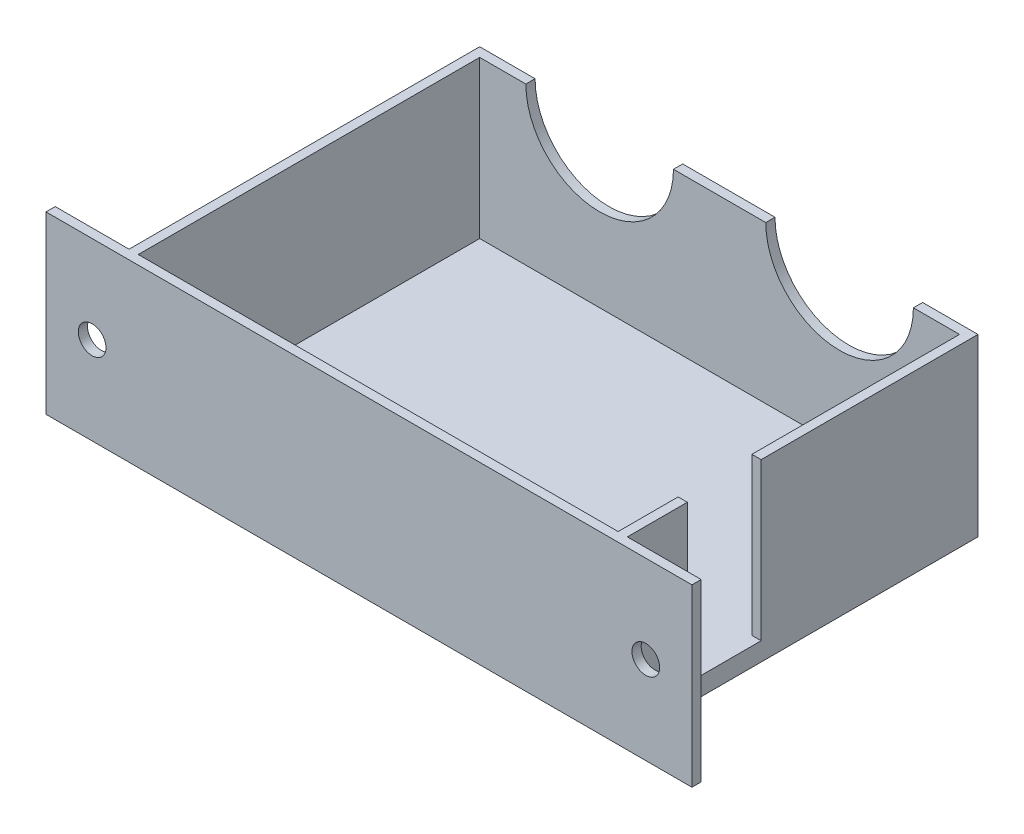
ISO-10303-21;
HEADER;
FILE_DESCRIPTION(('STEP AP214'),'2;1');
FILE_NAME('part.step','',(''),(''),'','','');
FILE_SCHEMA(('AUTOMOTIVE_DESIGN { 1 0 10303 214 1 1 1 1 }'));
ENDSEC;
DATA;
#1=APPLICATION_CONTEXT('core data for automotive mechanical design processes');
#2=APPLICATION_PROTOCOL_DEFINITION('international standard','automotive_design',2000,#1);
#3=PRODUCT_CONTEXT('',#1,'mechanical');
#4=PRODUCT('Part','Part','',(#3));
#5=PRODUCT_RELATED_PRODUCT_CATEGORY('part','',(#4));
#6=PRODUCT_DEFINITION_FORMATION('','',#4);
#7=PRODUCT_DEFINITION_CONTEXT('part definition',#1,'design');
#8=PRODUCT_DEFINITION('design','',#6,#7);
#9=PRODUCT_DEFINITION_SHAPE('','',#8);
#10=(LENGTH_UNIT() NAMED_UNIT(*) SI_UNIT(.MILLI.,.METRE.));
#11=(NAMED_UNIT(*) PLANE_ANGLE_UNIT() SI_UNIT($,.RADIAN.));
#12=(NAMED_UNIT(*) SI_UNIT($,.STERADIAN.) SOLID_ANGLE_UNIT());
#13=UNCERTAINTY_MEASURE_WITH_UNIT(LENGTH_MEASURE(1.E-05),#10,'distance_accuracy_value','');
#14=(GEOMETRIC_REPRESENTATION_CONTEXT(3) GLOBAL_UNCERTAINTY_ASSIGNED_CONTEXT((#13)) GLOBAL_UNIT_ASSIGNED_CONTEXT((#10,
#11,#12)) REPRESENTATION_CONTEXT('',''));
#15=CARTESIAN_POINT('',(0.,0.,0.));
#16=DIRECTION('',(0.,0.,1.));
#17=DIRECTION('',(1.,0.,0.));
#18=AXIS2_PLACEMENT_3D('',#15,#16,#17);
#19=CARTESIAN_POINT('',(0.,19.,0.));
#20=DIRECTION('',(0.,-1.,0.));
#21=DIRECTION('',(0.,0.,-1.));
#22=AXIS2_PLACEMENT_3D('',#19,#20,#21);
#23=PLANE('',#22);
#24=DIRECTION('',(0.,0.,-1.));
#25=VECTOR('',#24,1.);
#26=CARTESIAN_POINT('',(54.,19.,-0.999999999999994));
#27=LINE('',#26,#25);
#28=CARTESIAN_POINT('',(54.,19.,-0.999999999999994));
#29=VERTEX_POINT('',#28);
#30=CARTESIAN_POINT('',(54.,19.,-7.5));
#31=VERTEX_POINT('',#30);
#32=EDGE_CURVE('E246',#29,#31,#27,.T.);
#33=ORIENTED_EDGE('',*,*,#32,.T.);
#34=DIRECTION('',(1.,0.,0.));
#35=VECTOR('',#34,1.);
#36=CARTESIAN_POINT('',(53.,19.,-7.5));
#37=LINE('',#36,#35);
#38=CARTESIAN_POINT('',(53.,19.,-7.5));
#39=VERTEX_POINT('',#38);
#40=EDGE_CURVE('E334',#39,#31,#37,.T.);
#41=ORIENTED_EDGE('',*,*,#40,.F.);
#42=DIRECTION('',(0.,0.,-1.));
#43=VECTOR('',#42,1.);
#44=CARTESIAN_POINT('',(53.,19.,-0.999999999999994));
#45=LINE('',#44,#43);
#46=CARTESIAN_POINT('',(53.,19.,-0.999999999999994));
#47=VERTEX_POINT('',#46);
#48=EDGE_CURVE('E189',#47,#39,#45,.T.);
#49=ORIENTED_EDGE('',*,*,#48,.F.);
#50=DIRECTION('',(1.,0.,0.));
#51=VECTOR('',#50,1.);
#52=CARTESIAN_POINT('',(1.,19.,-0.999999999999994));
#53=LINE('',#52,#51);
#54=CARTESIAN_POINT('',(1.,19.,-0.999999999999994));
#55=VERTEX_POINT('',#54);
#56=EDGE_CURVE('E218',#55,#47,#53,.T.);
#57=ORIENTED_EDGE('',*,*,#56,.F.);
#58=DIRECTION('',(0.,0.,1.));
#59=VECTOR('',#58,1.);
#60=CARTESIAN_POINT('',(1.,19.,-0.999999999999994));
#61=LINE('',#60,#59);
#62=CARTESIAN_POINT('',(1.,19.,-38.));
#63=VERTEX_POINT('',#62);
#64=EDGE_CURVE('E212',#63,#55,#61,.T.);
#65=ORIENTED_EDGE('',*,*,#64,.F.);
#66=DIRECTION('',(-1.,0.,0.));
#67=VECTOR('',#66,1.);
#68=CARTESIAN_POINT('',(1.,19.,-38.));
#69=LINE('',#68,#67);
#70=CARTESIAN_POINT('',(6.,19.,-38.));
#71=VERTEX_POINT('',#70);
#72=EDGE_CURVE('E222',#71,#63,#69,.T.);
#73=ORIENTED_EDGE('',*,*,#72,.F.);
#74=DIRECTION('',(0.,0.,-1.));
#75=VECTOR('',#74,1.);
#76=CARTESIAN_POINT('',(6.,19.,0.001000000000001));
#77=LINE('',#76,#75);
#78=CARTESIAN_POINT('',(6.,19.,-39.));
#79=VERTEX_POINT('',#78);
#80=EDGE_CURVE('E56',#79,#71,#77,.F.);
#81=ORIENTED_EDGE('',*,*,#80,.F.);
#82=DIRECTION('',(-1.,0.,0.));
#83=VECTOR('',#82,1.);
#84=CARTESIAN_POINT('',(0.,19.,-39.));
#85=LINE('',#84,#83);
#86=CARTESIAN_POINT('',(0.,19.,-39.));
#87=VERTEX_POINT('',#86);
#88=EDGE_CURVE('E249',#79,#87,#85,.T.);
#89=ORIENTED_EDGE('',*,*,#88,.T.);
#90=DIRECTION('',(0.,0.,1.));
#91=VECTOR('',#90,1.);
#92=CARTESIAN_POINT('',(0.,19.,-0.999999999999999));
#93=LINE('',#92,#91);
#94=CARTESIAN_POINT('',(0.,19.,-0.999999999999999));
#95=VERTEX_POINT('',#94);
#96=EDGE_CURVE('E253',#87,#95,#93,.T.);
#97=ORIENTED_EDGE('',*,*,#96,.T.);
#98=DIRECTION('',(-1.,0.,0.));
#99=VECTOR('',#98,1.);
#100=CARTESIAN_POINT('',(-8.,19.,-0.999999999999995));
#101=LINE('',#100,#99);
#102=CARTESIAN_POINT('',(-8.,19.,-0.999999999999995));
#103=VERTEX_POINT('',#102);
#104=EDGE_CURVE('E256',#95,#103,#101,.T.);
#105=ORIENTED_EDGE('',*,*,#104,.T.);
#106=DIRECTION('',(0.,0.,1.));
#107=VECTOR('',#106,1.);
#108=CARTESIAN_POINT('',(-8.,19.,0.));
#109=LINE('',#108,#107);
#110=CARTESIAN_POINT('',(-8.,19.,0.));
#111=VERTEX_POINT('',#110);
#112=EDGE_CURVE('E258',#103,#111,#109,.T.);
#113=ORIENTED_EDGE('',*,*,#112,.T.);
#114=DIRECTION('',(1.,0.,0.));
#115=VECTOR('',#114,1.);
#116=CARTESIAN_POINT('',(0.,19.,0.));
#117=LINE('',#116,#115);
#118=CARTESIAN_POINT('',(62.,19.,0.));
#119=VERTEX_POINT('',#118);
#120=EDGE_CURVE('E238',#111,#119,#117,.T.);
#121=ORIENTED_EDGE('',*,*,#120,.T.);
#122=DIRECTION('',(0.,0.,-1.));
#123=VECTOR('',#122,1.);
#124=CARTESIAN_POINT('',(62.,19.,0.));
#125=LINE('',#124,#123);
#126=CARTESIAN_POINT('',(62.,19.,-0.999999999999995));
#127=VERTEX_POINT('',#126);
#128=EDGE_CURVE('E240',#119,#127,#125,.T.);
#129=ORIENTED_EDGE('',*,*,#128,.T.);
#130=DIRECTION('',(-1.,0.,0.));
#131=VECTOR('',#130,1.);
#132=CARTESIAN_POINT('',(62.,19.,-0.999999999999995));
#133=LINE('',#132,#131);
#134=EDGE_CURVE('E243',#127,#29,#133,.T.);
#135=ORIENTED_EDGE('',*,*,#134,.T.);
#136=EDGE_LOOP('',(#33,#41,#49,#57,#65,#73,#81,#89,#97,#105,#113,#121,#129,#135));
#137=FACE_BOUND('',#136,.T.);
#138=ADVANCED_FACE('F33',(#137),#23,.F.);
#139=CARTESIAN_POINT('',(53.,19.,-0.999999999999994));
#140=DIRECTION('',(-1.,0.,0.));
#141=DIRECTION('',(0.,0.,1.));
#142=AXIS2_PLACEMENT_3D('',#139,#140,#141);
#143=PLANE('',#142);
#144=DIRECTION('',(0.,-1.,0.));
#145=VECTOR('',#144,1.);
#146=CARTESIAN_POINT('',(53.,19.,-7.5));
#147=LINE('',#146,#145);
#148=CARTESIAN_POINT('',(53.,2.,-7.5));
#149=VERTEX_POINT('',#148);
#150=EDGE_CURVE('E172',#39,#149,#147,.T.);
#151=ORIENTED_EDGE('',*,*,#150,.T.);
#152=DIRECTION('',(0.,0.,-1.));
#153=VECTOR('',#152,1.);
#154=CARTESIAN_POINT('',(53.,2.,-38.));
#155=LINE('',#154,#153);
#156=CARTESIAN_POINT('',(53.,2.,-0.999999999999994));
#157=VERTEX_POINT('',#156);
#158=EDGE_CURVE('E186',#157,#149,#155,.T.);
#159=ORIENTED_EDGE('',*,*,#158,.F.);
#160=DIRECTION('',(0.,-1.,0.));
#161=VECTOR('',#160,1.);
#162=CARTESIAN_POINT('',(53.,19.,-0.999999999999994));
#163=LINE('',#162,#161);
#164=EDGE_CURVE('E232',#47,#157,#163,.T.);
#165=ORIENTED_EDGE('',*,*,#164,.F.);
#166=ORIENTED_EDGE('',*,*,#48,.T.);
#167=EDGE_LOOP('',(#151,#159,#165,#166));
#168=FACE_BOUND('',#167,.T.);
#169=ADVANCED_FACE('F184',(#168),#143,.T.);
#170=CARTESIAN_POINT('',(53.,19.,-15.5));
#171=VERTEX_POINT('',#170);
#172=CARTESIAN_POINT('',(53.,19.,-38.));
#173=VERTEX_POINT('',#172);
#174=EDGE_CURVE('E220',#171,#173,#45,.T.);
#175=ORIENTED_EDGE('',*,*,#174,.F.);
#176=DIRECTION('',(1.,0.,0.));
#177=VECTOR('',#176,1.);
#178=CARTESIAN_POINT('',(53.,19.,-15.5));
#179=LINE('',#178,#177);
#180=CARTESIAN_POINT('',(54.,19.,-15.5));
#181=VERTEX_POINT('',#180);
#182=EDGE_CURVE('E327',#171,#181,#179,.T.);
#183=ORIENTED_EDGE('',*,*,#182,.T.);
#184=CARTESIAN_POINT('',(54.,19.,-39.));
#185=VERTEX_POINT('',#184);
#186=EDGE_CURVE('E245',#181,#185,#27,.T.);
#187=ORIENTED_EDGE('',*,*,#186,.T.);
#188=CARTESIAN_POINT('',(48.,19.,-39.));
#189=VERTEX_POINT('',#188);
#190=EDGE_CURVE('E250',#185,#189,#85,.T.);
#191=ORIENTED_EDGE('',*,*,#190,.T.);
#192=DIRECTION('',(0.,0.,-1.));
#193=VECTOR('',#192,1.);
#194=CARTESIAN_POINT('',(48.,19.,0.001000000000001));
#195=LINE('',#194,#193);
#196=CARTESIAN_POINT('',(48.,19.,-38.));
#197=VERTEX_POINT('',#196);
#198=EDGE_CURVE('E325',#197,#189,#195,.T.);
#199=ORIENTED_EDGE('',*,*,#198,.F.);
#200=EDGE_CURVE('E223',#173,#197,#69,.T.);
#201=ORIENTED_EDGE('',*,*,#200,.F.);
#202=EDGE_LOOP('',(#175,#183,#187,#191,#199,#201));
#203=FACE_BOUND('',#202,.T.);
#204=ADVANCED_FACE('F323',(#203),#23,.F.);
#205=CARTESIAN_POINT('',(32.,19.,-39.));
#206=VERTEX_POINT('',#205);
#207=CARTESIAN_POINT('',(22.,19.,-39.));
#208=VERTEX_POINT('',#207);
#209=EDGE_CURVE('E254',#206,#208,#85,.T.);
#210=ORIENTED_EDGE('',*,*,#209,.T.);
#211=DIRECTION('',(0.,0.,-1.));
#212=VECTOR('',#211,1.);
#213=CARTESIAN_POINT('',(22.,19.,0.001000000000001));
#214=LINE('',#213,#212);
#215=CARTESIAN_POINT('',(22.,19.,-38.));
#216=VERTEX_POINT('',#215);
#217=EDGE_CURVE('E338',#216,#208,#214,.T.);
#218=ORIENTED_EDGE('',*,*,#217,.F.);
#219=CARTESIAN_POINT('',(32.,19.,-38.));
#220=VERTEX_POINT('',#219);
#221=EDGE_CURVE('E227',#220,#216,#69,.T.);
#222=ORIENTED_EDGE('',*,*,#221,.F.);
#223=DIRECTION('',(0.,0.,-1.));
#224=VECTOR('',#223,1.);
#225=CARTESIAN_POINT('',(32.,19.,0.001000000000001));
#226=LINE('',#225,#224);
#227=EDGE_CURVE('E348',#206,#220,#226,.F.);
#228=ORIENTED_EDGE('',*,*,#227,.F.);
#229=EDGE_LOOP('',(#210,#218,#222,#228));
#230=FACE_BOUND('',#229,.T.);
#231=ADVANCED_FACE('F377',(#230),#23,.F.);
#232=CARTESIAN_POINT('',(0.,0.,0.));
#233=DIRECTION('',(0.,-1.,0.));
#234=DIRECTION('',(0.,0.,-1.));
#235=AXIS2_PLACEMENT_3D('',#232,#233,#234);
#236=PLANE('',#235);
#237=DIRECTION('',(1.,0.,0.));
#238=VECTOR('',#237,1.);
#239=CARTESIAN_POINT('',(54.,0.,0.));
#240=LINE('',#239,#238);
#241=CARTESIAN_POINT('',(-8.,0.,0.));
#242=VERTEX_POINT('',#241);
#243=CARTESIAN_POINT('',(62.,0.,0.));
#244=VERTEX_POINT('',#243);
#245=EDGE_CURVE('E237',#242,#244,#240,.T.);
#246=ORIENTED_EDGE('',*,*,#245,.F.);
#247=DIRECTION('',(0.,0.,1.));
#248=VECTOR('',#247,1.);
#249=CARTESIAN_POINT('',(-8.,0.,0.));
#250=LINE('',#249,#248);
#251=CARTESIAN_POINT('',(-8.,0.,-0.999999999999995));
#252=VERTEX_POINT('',#251);
#253=EDGE_CURVE('E241',#252,#242,#250,.T.);
#254=ORIENTED_EDGE('',*,*,#253,.F.);
#255=DIRECTION('',(-1.,0.,0.));
#256=VECTOR('',#255,1.);
#257=CARTESIAN_POINT('',(-8.,0.,-0.999999999999995));
#258=LINE('',#257,#256);
#259=CARTESIAN_POINT('',(0.,0.,-0.999999999999999));
#260=VERTEX_POINT('',#259);
#261=EDGE_CURVE('E272',#260,#252,#258,.T.);
#262=ORIENTED_EDGE('',*,*,#261,.F.);
#263=DIRECTION('',(0.,0.,1.));
#264=VECTOR('',#263,1.);
#265=CARTESIAN_POINT('',(0.,0.,-0.999999999999999));
#266=LINE('',#265,#264);
#267=CARTESIAN_POINT('',(0.,0.,-39.));
#268=VERTEX_POINT('',#267);
#269=EDGE_CURVE('E270',#268,#260,#266,.T.);
#270=ORIENTED_EDGE('',*,*,#269,.F.);
#271=DIRECTION('',(-1.,0.,0.));
#272=VECTOR('',#271,1.);
#273=CARTESIAN_POINT('',(0.,0.,-39.));
#274=LINE('',#273,#272);
#275=CARTESIAN_POINT('',(54.,0.,-39.));
#276=VERTEX_POINT('',#275);
#277=EDGE_CURVE('E268',#276,#268,#274,.T.);
#278=ORIENTED_EDGE('',*,*,#277,.F.);
#279=DIRECTION('',(0.,0.,-1.));
#280=VECTOR('',#279,1.);
#281=CARTESIAN_POINT('',(54.,0.,-0.999999999999994));
#282=LINE('',#281,#280);
#283=CARTESIAN_POINT('',(54.,0.,-0.999999999999994));
#284=VERTEX_POINT('',#283);
#285=EDGE_CURVE('E266',#284,#276,#282,.T.);
#286=ORIENTED_EDGE('',*,*,#285,.F.);
#287=DIRECTION('',(-1.,0.,0.));
#288=VECTOR('',#287,1.);
#289=CARTESIAN_POINT('',(62.,0.,-0.999999999999995));
#290=LINE('',#289,#288);
#291=CARTESIAN_POINT('',(62.,0.,-0.999999999999995));
#292=VERTEX_POINT('',#291);
#293=EDGE_CURVE('E264',#292,#284,#290,.T.);
#294=ORIENTED_EDGE('',*,*,#293,.F.);
#295=DIRECTION('',(0.,0.,-1.));
#296=VECTOR('',#295,1.);
#297=CARTESIAN_POINT('',(62.,0.,0.));
#298=LINE('',#297,#296);
#299=EDGE_CURVE('E262',#244,#292,#298,.T.);
#300=ORIENTED_EDGE('',*,*,#299,.F.);
#301=EDGE_LOOP('',(#246,#254,#262,#270,#278,#286,#294,#300));
#302=FACE_BOUND('',#301,.T.);
#303=ADVANCED_FACE('F304',(#302),#236,.T.);
#304=CARTESIAN_POINT('',(54.,19.,0.));
#305=DIRECTION('',(0.,0.,-1.));
#306=DIRECTION('',(-1.,0.,0.));
#307=AXIS2_PLACEMENT_3D('',#304,#305,#306);
#308=PLANE('',#307);
#309=CARTESIAN_POINT('',(-3.,9.5,0.));
#310=DIRECTION('',(0.,0.,1.));
#311=DIRECTION('',(1.,0.,0.));
#312=AXIS2_PLACEMENT_3D('',#309,#310,#311);
#313=CIRCLE('',#312,1.5);
#314=CARTESIAN_POINT('',(-1.5,9.5,0.));
#315=VERTEX_POINT('',#314);
#316=EDGE_CURVE('E205',#315,#315,#313,.T.);
#317=ORIENTED_EDGE('',*,*,#316,.F.);
#318=EDGE_LOOP('',(#317));
#319=FACE_BOUND('',#318,.T.);
#320=CARTESIAN_POINT('',(57.,9.5,0.));
#321=DIRECTION('',(0.,0.,1.));
#322=DIRECTION('',(1.,0.,0.));
#323=AXIS2_PLACEMENT_3D('',#320,#321,#322);
#324=CIRCLE('',#323,1.5);
#325=CARTESIAN_POINT('',(58.5,9.5,0.));
#326=VERTEX_POINT('',#325);
#327=EDGE_CURVE('E200',#326,#326,#324,.T.);
#328=ORIENTED_EDGE('',*,*,#327,.F.);
#329=EDGE_LOOP('',(#328));
#330=FACE_BOUND('',#329,.T.);
#331=ORIENTED_EDGE('',*,*,#245,.T.);
#332=DIRECTION('',(0.,-1.,0.));
#333=VECTOR('',#332,1.);
#334=CARTESIAN_POINT('',(62.,19.,0.));
#335=LINE('',#334,#333);
#336=EDGE_CURVE('E11',#119,#244,#335,.T.);
#337=ORIENTED_EDGE('',*,*,#336,.F.);
#338=ORIENTED_EDGE('',*,*,#120,.F.);
#339=DIRECTION('',(0.,-1.,0.));
#340=VECTOR('',#339,1.);
#341=CARTESIAN_POINT('',(-8.,19.,0.));
#342=LINE('',#341,#340);
#343=EDGE_CURVE('E260',#111,#242,#342,.T.);
#344=ORIENTED_EDGE('',*,*,#343,.T.);
#345=EDGE_LOOP('',(#331,#337,#338,#344));
#346=FACE_BOUND('',#345,.T.);
#347=ADVANCED_FACE('F35',(#319,#330,#346),#308,.F.);
#348=CARTESIAN_POINT('',(62.,19.,0.));
#349=DIRECTION('',(-1.,0.,0.));
#350=DIRECTION('',(0.,0.,1.));
#351=AXIS2_PLACEMENT_3D('',#348,#349,#350);
#352=PLANE('',#351);
#353=ORIENTED_EDGE('',*,*,#299,.T.);
#354=DIRECTION('',(0.,-1.,0.));
#355=VECTOR('',#354,1.);
#356=CARTESIAN_POINT('',(62.,19.,-0.999999999999995));
#357=LINE('',#356,#355);
#358=EDGE_CURVE('E41',#127,#292,#357,.T.);
#359=ORIENTED_EDGE('',*,*,#358,.F.);
#360=ORIENTED_EDGE('',*,*,#128,.F.);
#361=ORIENTED_EDGE('',*,*,#336,.T.);
#362=EDGE_LOOP('',(#353,#359,#360,#361));
#363=FACE_BOUND('',#362,.T.);
#364=ADVANCED_FACE('F397',(#363),#352,.F.);
#365=CARTESIAN_POINT('',(62.,19.,-0.999999999999995));
#366=DIRECTION('',(0.,0.,1.));
#367=DIRECTION('',(1.,0.,0.));
#368=AXIS2_PLACEMENT_3D('',#365,#366,#367);
#369=PLANE('',#368);
#370=CARTESIAN_POINT('',(57.,9.5,-0.999999999999994));
#371=DIRECTION('',(0.,0.,1.));
#372=DIRECTION('',(1.,0.,0.));
#373=AXIS2_PLACEMENT_3D('',#370,#371,#372);
#374=CIRCLE('',#373,1.5);
#375=CARTESIAN_POINT('',(58.5,9.5,-0.999999999999994));
#376=VERTEX_POINT('',#375);
#377=EDGE_CURVE('E209',#376,#376,#374,.F.);
#378=ORIENTED_EDGE('',*,*,#377,.F.);
#379=EDGE_LOOP('',(#378));
#380=FACE_BOUND('',#379,.T.);
#381=ORIENTED_EDGE('',*,*,#293,.T.);
#382=DIRECTION('',(0.,-1.,0.));
#383=VECTOR('',#382,1.);
#384=CARTESIAN_POINT('',(54.,19.,-0.999999999999994));
#385=LINE('',#384,#383);
#386=EDGE_CURVE('E290',#29,#284,#385,.T.);
#387=ORIENTED_EDGE('',*,*,#386,.F.);
#388=ORIENTED_EDGE('',*,*,#134,.F.);
#389=ORIENTED_EDGE('',*,*,#358,.T.);
#390=EDGE_LOOP('',(#381,#387,#388,#389));
#391=FACE_BOUND('',#390,.T.);
#392=ADVANCED_FACE('F297',(#380,#391),#369,.F.);
#393=CARTESIAN_POINT('',(54.,19.,-0.999999999999994));
#394=DIRECTION('',(-1.,0.,0.));
#395=DIRECTION('',(0.,0.,1.));
#396=AXIS2_PLACEMENT_3D('',#393,#394,#395);
#397=PLANE('',#396);
#398=DIRECTION('',(0.,0.,-1.));
#399=VECTOR('',#398,1.);
#400=CARTESIAN_POINT('',(54.,2.,-7.5));
#401=LINE('',#400,#399);
#402=CARTESIAN_POINT('',(54.,2.,-7.5));
#403=VERTEX_POINT('',#402);
#404=CARTESIAN_POINT('',(54.,2.,-15.5));
#405=VERTEX_POINT('',#404);
#406=EDGE_CURVE('E329',#403,#405,#401,.T.);
#407=ORIENTED_EDGE('',*,*,#406,.F.);
#408=DIRECTION('',(0.,-1.,0.));
#409=VECTOR('',#408,1.);
#410=CARTESIAN_POINT('',(54.,19.,-7.5));
#411=LINE('',#410,#409);
#412=EDGE_CURVE('E175',#31,#403,#411,.T.);
#413=ORIENTED_EDGE('',*,*,#412,.F.);
#414=ORIENTED_EDGE('',*,*,#32,.F.);
#415=ORIENTED_EDGE('',*,*,#386,.T.);
#416=ORIENTED_EDGE('',*,*,#285,.T.);
#417=DIRECTION('',(0.,-1.,0.));
#418=VECTOR('',#417,1.);
#419=CARTESIAN_POINT('',(54.,19.,-39.));
#420=LINE('',#419,#418);
#421=EDGE_CURVE('E287',#185,#276,#420,.T.);
#422=ORIENTED_EDGE('',*,*,#421,.F.);
#423=ORIENTED_EDGE('',*,*,#186,.F.);
#424=DIRECTION('',(0.,1.,0.));
#425=VECTOR('',#424,1.);
#426=CARTESIAN_POINT('',(54.,19.,-15.5));
#427=LINE('',#426,#425);
#428=EDGE_CURVE('E190',#405,#181,#427,.T.);
#429=ORIENTED_EDGE('',*,*,#428,.F.);
#430=EDGE_LOOP('',(#407,#413,#414,#415,#416,#422,#423,#429));
#431=FACE_BOUND('',#430,.T.);
#432=ADVANCED_FACE('F309',(#431),#397,.F.);
#433=CARTESIAN_POINT('',(0.,19.,-39.));
#434=DIRECTION('',(0.,0.,1.));
#435=DIRECTION('',(1.,0.,0.));
#436=AXIS2_PLACEMENT_3D('',#433,#434,#435);
#437=PLANE('',#436);
#438=ORIENTED_EDGE('',*,*,#88,.F.);
#439=CARTESIAN_POINT('',(14.,19.,-39.));
#440=DIRECTION('',(0.,0.,-1.));
#441=DIRECTION('',(-1.,0.,0.));
#442=AXIS2_PLACEMENT_3D('',#439,#440,#441);
#443=CIRCLE('',#442,8.);
#444=EDGE_CURVE('E342',#208,#79,#443,.T.);
#445=ORIENTED_EDGE('',*,*,#444,.F.);
#446=ORIENTED_EDGE('',*,*,#209,.F.);
#447=CARTESIAN_POINT('',(40.,19.,-39.));
#448=DIRECTION('',(0.,0.,-1.));
#449=DIRECTION('',(-1.,0.,0.));
#450=AXIS2_PLACEMENT_3D('',#447,#448,#449);
#451=CIRCLE('',#450,7.99999999999998);
#452=EDGE_CURVE('E319',#189,#206,#451,.T.);
#453=ORIENTED_EDGE('',*,*,#452,.F.);
#454=ORIENTED_EDGE('',*,*,#190,.F.);
#455=ORIENTED_EDGE('',*,*,#421,.T.);
#456=ORIENTED_EDGE('',*,*,#277,.T.);
#457=DIRECTION('',(0.,-1.,0.));
#458=VECTOR('',#457,1.);
#459=CARTESIAN_POINT('',(0.,19.,-39.));
#460=LINE('',#459,#458);
#461=EDGE_CURVE('E284',#87,#268,#460,.T.);
#462=ORIENTED_EDGE('',*,*,#461,.F.);
#463=EDGE_LOOP('',(#438,#445,#446,#453,#454,#455,#456,#462));
#464=FACE_BOUND('',#463,.T.);
#465=ADVANCED_FACE('F315',(#464),#437,.F.);
#466=CARTESIAN_POINT('',(0.,19.,-0.999999999999999));
#467=DIRECTION('',(1.,0.,0.));
#468=DIRECTION('',(0.,0.,-1.));
#469=AXIS2_PLACEMENT_3D('',#466,#467,#468);
#470=PLANE('',#469);
#471=ORIENTED_EDGE('',*,*,#269,.T.);
#472=DIRECTION('',(0.,-1.,0.));
#473=VECTOR('',#472,1.);
#474=CARTESIAN_POINT('',(0.,19.,-0.999999999999999));
#475=LINE('',#474,#473);
#476=EDGE_CURVE('E281',#95,#260,#475,.T.);
#477=ORIENTED_EDGE('',*,*,#476,.F.);
#478=ORIENTED_EDGE('',*,*,#96,.F.);
#479=ORIENTED_EDGE('',*,*,#461,.T.);
#480=EDGE_LOOP('',(#471,#477,#478,#479));
#481=FACE_BOUND('',#480,.T.);
#482=ADVANCED_FACE('F385',(#481),#470,.F.);
#483=CARTESIAN_POINT('',(-8.,19.,-0.999999999999995));
#484=DIRECTION('',(0.,0.,1.));
#485=DIRECTION('',(1.,0.,0.));
#486=AXIS2_PLACEMENT_3D('',#483,#484,#485);
#487=PLANE('',#486);
#488=CARTESIAN_POINT('',(-3.,9.5,-0.999999999999994));
#489=DIRECTION('',(0.,0.,1.));
#490=DIRECTION('',(1.,0.,0.));
#491=AXIS2_PLACEMENT_3D('',#488,#489,#490);
#492=CIRCLE('',#491,1.5);
#493=CARTESIAN_POINT('',(-1.5,9.5,-0.999999999999995));
#494=VERTEX_POINT('',#493);
#495=EDGE_CURVE('E208',#494,#494,#492,.F.);
#496=ORIENTED_EDGE('',*,*,#495,.F.);
#497=EDGE_LOOP('',(#496));
#498=FACE_BOUND('',#497,.T.);
#499=ORIENTED_EDGE('',*,*,#261,.T.);
#500=DIRECTION('',(0.,-1.,0.));
#501=VECTOR('',#500,1.);
#502=CARTESIAN_POINT('',(-8.,19.,-0.999999999999995));
#503=LINE('',#502,#501);
#504=EDGE_CURVE('E278',#103,#252,#503,.T.);
#505=ORIENTED_EDGE('',*,*,#504,.F.);
#506=ORIENTED_EDGE('',*,*,#104,.F.);
#507=ORIENTED_EDGE('',*,*,#476,.T.);
#508=EDGE_LOOP('',(#499,#505,#506,#507));
#509=FACE_BOUND('',#508,.T.);
#510=ADVANCED_FACE('F388',(#498,#509),#487,.F.);
#511=CARTESIAN_POINT('',(-8.,19.,0.));
#512=DIRECTION('',(1.,0.,0.));
#513=DIRECTION('',(0.,0.,-1.));
#514=AXIS2_PLACEMENT_3D('',#511,#512,#513);
#515=PLANE('',#514);
#516=ORIENTED_EDGE('',*,*,#253,.T.);
#517=ORIENTED_EDGE('',*,*,#343,.F.);
#518=ORIENTED_EDGE('',*,*,#112,.F.);
#519=ORIENTED_EDGE('',*,*,#504,.T.);
#520=EDGE_LOOP('',(#516,#517,#518,#519));
#521=FACE_BOUND('',#520,.T.);
#522=ADVANCED_FACE('F393',(#521),#515,.F.);
#523=CARTESIAN_POINT('',(1.,19.,-0.999999999999994));
#524=DIRECTION('',(1.,0.,0.));
#525=DIRECTION('',(0.,0.,-1.));
#526=AXIS2_PLACEMENT_3D('',#523,#524,#525);
#527=PLANE('',#526);
#528=DIRECTION('',(0.,0.,1.));
#529=VECTOR('',#528,1.);
#530=CARTESIAN_POINT('',(1.,2.,-38.));
#531=LINE('',#530,#529);
#532=CARTESIAN_POINT('',(1.,2.,-38.));
#533=VERTEX_POINT('',#532);
#534=CARTESIAN_POINT('',(1.,2.,-0.999999999999994));
#535=VERTEX_POINT('',#534);
#536=EDGE_CURVE('E346',#533,#535,#531,.T.);
#537=ORIENTED_EDGE('',*,*,#536,.F.);
#538=DIRECTION('',(0.,-1.,0.));
#539=VECTOR('',#538,1.);
#540=CARTESIAN_POINT('',(1.,19.,-38.));
#541=LINE('',#540,#539);
#542=EDGE_CURVE('E226',#63,#533,#541,.T.);
#543=ORIENTED_EDGE('',*,*,#542,.F.);
#544=ORIENTED_EDGE('',*,*,#64,.T.);
#545=DIRECTION('',(0.,-1.,0.));
#546=VECTOR('',#545,1.);
#547=CARTESIAN_POINT('',(1.,19.,-0.999999999999994));
#548=LINE('',#547,#546);
#549=EDGE_CURVE('E234',#55,#535,#548,.T.);
#550=ORIENTED_EDGE('',*,*,#549,.T.);
#551=EDGE_LOOP('',(#537,#543,#544,#550));
#552=FACE_BOUND('',#551,.T.);
#553=ADVANCED_FACE('F356',(#552),#527,.T.);
#554=CARTESIAN_POINT('',(1.,19.,-0.999999999999994));
#555=DIRECTION('',(0.,0.,-1.));
#556=DIRECTION('',(-1.,0.,0.));
#557=AXIS2_PLACEMENT_3D('',#554,#555,#556);
#558=PLANE('',#557);
#559=DIRECTION('',(1.,0.,0.));
#560=VECTOR('',#559,1.);
#561=CARTESIAN_POINT('',(1.00000000000001,2.,-1.));
#562=LINE('',#561,#560);
#563=EDGE_CURVE('E195',#535,#157,#562,.T.);
#564=ORIENTED_EDGE('',*,*,#563,.F.);
#565=ORIENTED_EDGE('',*,*,#549,.F.);
#566=ORIENTED_EDGE('',*,*,#56,.T.);
#567=ORIENTED_EDGE('',*,*,#164,.T.);
#568=EDGE_LOOP('',(#564,#565,#566,#567));
#569=FACE_BOUND('',#568,.T.);
#570=ADVANCED_FACE('F361',(#569),#558,.T.);
#571=DIRECTION('',(0.,1.,0.));
#572=VECTOR('',#571,1.);
#573=CARTESIAN_POINT('',(53.,19.,-15.5));
#574=LINE('',#573,#572);
#575=CARTESIAN_POINT('',(53.,2.,-15.5));
#576=VERTEX_POINT('',#575);
#577=EDGE_CURVE('E48',#576,#171,#574,.T.);
#578=ORIENTED_EDGE('',*,*,#577,.T.);
#579=ORIENTED_EDGE('',*,*,#174,.T.);
#580=DIRECTION('',(0.,-1.,0.));
#581=VECTOR('',#580,1.);
#582=CARTESIAN_POINT('',(53.,19.,-38.));
#583=LINE('',#582,#581);
#584=CARTESIAN_POINT('',(53.,2.,-38.));
#585=VERTEX_POINT('',#584);
#586=EDGE_CURVE('E229',#173,#585,#583,.T.);
#587=ORIENTED_EDGE('',*,*,#586,.T.);
#588=EDGE_CURVE('E197',#576,#585,#155,.T.);
#589=ORIENTED_EDGE('',*,*,#588,.F.);
#590=EDGE_LOOP('',(#578,#579,#587,#589));
#591=FACE_BOUND('',#590,.T.);
#592=ADVANCED_FACE('F367',(#591),#143,.T.);
#593=CARTESIAN_POINT('',(1.,19.,-38.));
#594=DIRECTION('',(0.,0.,1.));
#595=DIRECTION('',(1.,0.,0.));
#596=AXIS2_PLACEMENT_3D('',#593,#594,#595);
#597=PLANE('',#596);
#598=CARTESIAN_POINT('',(14.,19.,-38.));
#599=DIRECTION('',(0.,0.,1.));
#600=DIRECTION('',(1.,0.,0.));
#601=AXIS2_PLACEMENT_3D('',#598,#599,#600);
#602=CIRCLE('',#601,8.);
#603=EDGE_CURVE('E344',#216,#71,#602,.F.);
#604=ORIENTED_EDGE('',*,*,#603,.T.);
#605=ORIENTED_EDGE('',*,*,#72,.T.);
#606=ORIENTED_EDGE('',*,*,#542,.T.);
#607=DIRECTION('',(-1.,0.,0.));
#608=VECTOR('',#607,1.);
#609=CARTESIAN_POINT('',(1.,2.,-38.));
#610=LINE('',#609,#608);
#611=EDGE_CURVE('E196',#585,#533,#610,.T.);
#612=ORIENTED_EDGE('',*,*,#611,.F.);
#613=ORIENTED_EDGE('',*,*,#586,.F.);
#614=ORIENTED_EDGE('',*,*,#200,.T.);
#615=CARTESIAN_POINT('',(40.,19.,-38.));
#616=DIRECTION('',(0.,0.,1.));
#617=DIRECTION('',(1.,0.,0.));
#618=AXIS2_PLACEMENT_3D('',#615,#616,#617);
#619=CIRCLE('',#618,7.99999999999998);
#620=EDGE_CURVE('E340',#197,#220,#619,.F.);
#621=ORIENTED_EDGE('',*,*,#620,.T.);
#622=ORIENTED_EDGE('',*,*,#221,.T.);
#623=EDGE_LOOP('',(#604,#605,#606,#612,#613,#614,#621,#622));
#624=FACE_BOUND('',#623,.T.);
#625=ADVANCED_FACE('F370',(#624),#597,.T.);
#626=CARTESIAN_POINT('',(-3.,9.5,-39.001));
#627=DIRECTION('',(0.,0.,1.));
#628=DIRECTION('',(1.,0.,0.));
#629=AXIS2_PLACEMENT_3D('',#626,#627,#628);
#630=CYLINDRICAL_SURFACE('',#629,1.5);
#631=ORIENTED_EDGE('',*,*,#316,.T.);
#632=EDGE_LOOP('',(#631));
#633=FACE_BOUND('',#632,.T.);
#634=ORIENTED_EDGE('',*,*,#495,.T.);
#635=EDGE_LOOP('',(#634));
#636=FACE_BOUND('',#635,.T.);
#637=ADVANCED_FACE('F478',(#633,#636),#630,.F.);
#638=CARTESIAN_POINT('',(57.,9.5,-39.001));
#639=DIRECTION('',(0.,0.,1.));
#640=DIRECTION('',(1.,0.,0.));
#641=AXIS2_PLACEMENT_3D('',#638,#639,#640);
#642=CYLINDRICAL_SURFACE('',#641,1.5);
#643=ORIENTED_EDGE('',*,*,#327,.T.);
#644=EDGE_LOOP('',(#643));
#645=FACE_BOUND('',#644,.T.);
#646=ORIENTED_EDGE('',*,*,#377,.T.);
#647=EDGE_LOOP('',(#646));
#648=FACE_BOUND('',#647,.T.);
#649=ADVANCED_FACE('F485',(#645,#648),#642,.F.);
#650=CARTESIAN_POINT('',(0.,2.,0.));
#651=DIRECTION('',(0.,1.,0.));
#652=DIRECTION('',(0.,0.,1.));
#653=AXIS2_PLACEMENT_3D('',#650,#651,#652);
#654=PLANE('',#653);
#655=ORIENTED_EDGE('',*,*,#536,.T.);
#656=ORIENTED_EDGE('',*,*,#563,.T.);
#657=ORIENTED_EDGE('',*,*,#158,.T.);
#658=DIRECTION('',(1.,0.,0.));
#659=VECTOR('',#658,1.);
#660=CARTESIAN_POINT('',(53.,2.,-7.5));
#661=LINE('',#660,#659);
#662=EDGE_CURVE('E169',#149,#403,#661,.T.);
#663=ORIENTED_EDGE('',*,*,#662,.T.);
#664=ORIENTED_EDGE('',*,*,#406,.T.);
#665=DIRECTION('',(1.,0.,0.));
#666=VECTOR('',#665,1.);
#667=CARTESIAN_POINT('',(53.,2.,-15.5));
#668=LINE('',#667,#666);
#669=EDGE_CURVE('E180',#576,#405,#668,.T.);
#670=ORIENTED_EDGE('',*,*,#669,.F.);
#671=ORIENTED_EDGE('',*,*,#588,.T.);
#672=ORIENTED_EDGE('',*,*,#611,.T.);
#673=EDGE_LOOP('',(#655,#656,#657,#663,#664,#670,#671,#672));
#674=FACE_BOUND('',#673,.T.);
#675=ADVANCED_FACE('F194',(#674),#654,.T.);
#676=CARTESIAN_POINT('',(40.,19.,0.001000000000001));
#677=DIRECTION('',(0.,0.,-1.));
#678=DIRECTION('',(-1.,0.,0.));
#679=AXIS2_PLACEMENT_3D('',#676,#677,#678);
#680=CYLINDRICAL_SURFACE('',#679,7.99999999999998);
#681=ORIENTED_EDGE('',*,*,#227,.T.);
#682=ORIENTED_EDGE('',*,*,#620,.F.);
#683=ORIENTED_EDGE('',*,*,#198,.T.);
#684=ORIENTED_EDGE('',*,*,#452,.T.);
#685=EDGE_LOOP('',(#681,#682,#683,#684));
#686=FACE_BOUND('',#685,.T.);
#687=ADVANCED_FACE('F499',(#686),#680,.F.);
#688=CARTESIAN_POINT('',(14.,19.,0.001000000000001));
#689=DIRECTION('',(0.,0.,-1.));
#690=DIRECTION('',(-1.,0.,0.));
#691=AXIS2_PLACEMENT_3D('',#688,#689,#690);
#692=CYLINDRICAL_SURFACE('',#691,8.);
#693=ORIENTED_EDGE('',*,*,#80,.T.);
#694=ORIENTED_EDGE('',*,*,#603,.F.);
#695=ORIENTED_EDGE('',*,*,#217,.T.);
#696=ORIENTED_EDGE('',*,*,#444,.T.);
#697=EDGE_LOOP('',(#693,#694,#695,#696));
#698=FACE_BOUND('',#697,.T.);
#699=ADVANCED_FACE('F379',(#698),#692,.F.);
#700=CARTESIAN_POINT('',(53.,19.,-7.5));
#701=DIRECTION('',(0.,0.,1.));
#702=DIRECTION('',(0.,-1.,0.));
#703=AXIS2_PLACEMENT_3D('',#700,#701,#702);
#704=PLANE('',#703);
#705=ORIENTED_EDGE('',*,*,#412,.T.);
#706=ORIENTED_EDGE('',*,*,#662,.F.);
#707=ORIENTED_EDGE('',*,*,#150,.F.);
#708=ORIENTED_EDGE('',*,*,#40,.T.);
#709=EDGE_LOOP('',(#705,#706,#707,#708));
#710=FACE_BOUND('',#709,.T.);
#711=ADVANCED_FACE('F171',(#710),#704,.F.);
#712=CARTESIAN_POINT('',(53.,19.,-15.5));
#713=DIRECTION('',(0.,0.,-1.));
#714=DIRECTION('',(0.,1.,0.));
#715=AXIS2_PLACEMENT_3D('',#712,#713,#714);
#716=PLANE('',#715);
#717=ORIENTED_EDGE('',*,*,#428,.T.);
#718=ORIENTED_EDGE('',*,*,#182,.F.);
#719=ORIENTED_EDGE('',*,*,#577,.F.);
#720=ORIENTED_EDGE('',*,*,#669,.T.);
#721=EDGE_LOOP('',(#717,#718,#719,#720));
#722=FACE_BOUND('',#721,.T.);
#723=ADVANCED_FACE('F518',(#722),#716,.F.);
#724=CLOSED_SHELL('',(#138,#169,#204,#231,#303,#347,#364,#392,#432,#465,#482,#510,#522,#553,
#570,#592,#625,#637,#649,#675,#687,#699,#711,#723));
#725=MANIFOLD_SOLID_BREP('B2',#724);
#726=ADVANCED_BREP_SHAPE_REPRESENTATION('',(#18,#725),#14);
#727=SHAPE_DEFINITION_REPRESENTATION(#9,#726);
ENDSEC;
END-ISO-10303-21;
